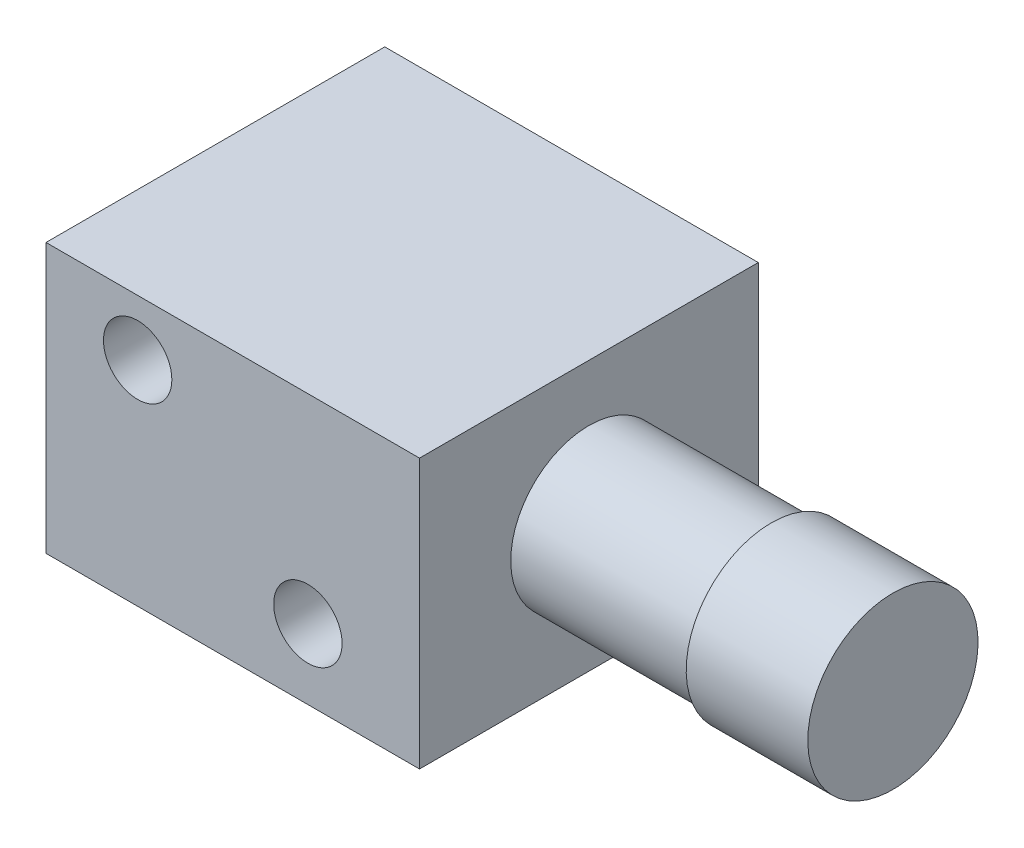
ISO-10303-21;
HEADER;
FILE_DESCRIPTION(('STEP AP214'),'2;1');
FILE_NAME('part.step','',(''),(''),'','','');
FILE_SCHEMA(('AUTOMOTIVE_DESIGN { 1 0 10303 214 1 1 1 1 }'));
ENDSEC;
DATA;
#1=APPLICATION_CONTEXT('core data for automotive mechanical design processes');
#2=APPLICATION_PROTOCOL_DEFINITION('international standard','automotive_design',2000,#1);
#3=PRODUCT_CONTEXT('',#1,'mechanical');
#4=PRODUCT('Part','Part','',(#3));
#5=PRODUCT_RELATED_PRODUCT_CATEGORY('part','',(#4));
#6=PRODUCT_DEFINITION_FORMATION('','',#4);
#7=PRODUCT_DEFINITION_CONTEXT('part definition',#1,'design');
#8=PRODUCT_DEFINITION('design','',#6,#7);
#9=PRODUCT_DEFINITION_SHAPE('','',#8);
#10=(LENGTH_UNIT() NAMED_UNIT(*) SI_UNIT(.MILLI.,.METRE.));
#11=(NAMED_UNIT(*) PLANE_ANGLE_UNIT() SI_UNIT($,.RADIAN.));
#12=(NAMED_UNIT(*) SI_UNIT($,.STERADIAN.) SOLID_ANGLE_UNIT());
#13=UNCERTAINTY_MEASURE_WITH_UNIT(LENGTH_MEASURE(1.E-05),#10,'distance_accuracy_value','');
#14=(GEOMETRIC_REPRESENTATION_CONTEXT(3) GLOBAL_UNCERTAINTY_ASSIGNED_CONTEXT((#13)) GLOBAL_UNIT_ASSIGNED_CONTEXT((#10,
#11,#12)) REPRESENTATION_CONTEXT('',''));
#15=CARTESIAN_POINT('',(0.,0.,0.));
#16=DIRECTION('',(0.,0.,1.));
#17=DIRECTION('',(1.,0.,0.));
#18=AXIS2_PLACEMENT_3D('',#15,#16,#17);
#19=CARTESIAN_POINT('',(-5.461,3.937,9.906));
#20=DIRECTION('',(1.,0.,0.));
#21=DIRECTION('',(0.,1.,0.));
#22=AXIS2_PLACEMENT_3D('',#19,#20,#21);
#23=PLANE('',#22);
#24=CARTESIAN_POINT('',(-5.461,0.,4.953));
#25=DIRECTION('',(-1.,0.,0.));
#26=DIRECTION('',(0.,-1.,0.));
#27=AXIS2_PLACEMENT_3D('',#24,#25,#26);
#28=CIRCLE('',#27,1.524);
#29=CARTESIAN_POINT('',(-5.461,-1.524,4.953));
#30=VERTEX_POINT('',#29);
#31=EDGE_CURVE('E59',#30,#30,#28,.T.);
#32=ORIENTED_EDGE('',*,*,#31,.F.);
#33=EDGE_LOOP('',(#32));
#34=FACE_BOUND('',#33,.T.);
#35=DIRECTION('',(0.,0.,-1.));
#36=VECTOR('',#35,1.);
#37=CARTESIAN_POINT('',(-5.461,0.634999999999999,0.254));
#38=LINE('',#37,#36);
#39=CARTESIAN_POINT('',(-5.461,0.635000000000001,0.254000000000001));
#40=VERTEX_POINT('',#39);
#41=CARTESIAN_POINT('',(-5.461,0.634999999999999,0.));
#42=VERTEX_POINT('',#41);
#43=EDGE_CURVE('E66',#40,#42,#38,.T.);
#44=ORIENTED_EDGE('',*,*,#43,.F.);
#45=DIRECTION('',(0.,1.,0.));
#46=VECTOR('',#45,1.);
#47=CARTESIAN_POINT('',(-5.461,0.634999999999999,0.254));
#48=LINE('',#47,#46);
#49=CARTESIAN_POINT('',(-5.461,-0.635000000000001,0.254000000000001));
#50=VERTEX_POINT('',#49);
#51=EDGE_CURVE('E71',#50,#40,#48,.T.);
#52=ORIENTED_EDGE('',*,*,#51,.F.);
#53=DIRECTION('',(0.,0.,-1.));
#54=VECTOR('',#53,1.);
#55=CARTESIAN_POINT('',(-5.461,-0.635000000000001,0.254));
#56=LINE('',#55,#54);
#57=CARTESIAN_POINT('',(-5.461,-0.635000000000001,0.));
#58=VERTEX_POINT('',#57);
#59=EDGE_CURVE('E140',#50,#58,#56,.T.);
#60=ORIENTED_EDGE('',*,*,#59,.T.);
#61=DIRECTION('',(0.,-1.,0.));
#62=VECTOR('',#61,1.);
#63=CARTESIAN_POINT('',(-5.461,3.937,0.));
#64=LINE('',#63,#62);
#65=CARTESIAN_POINT('',(-5.461,-3.937,0.));
#66=VERTEX_POINT('',#65);
#67=EDGE_CURVE('E225',#58,#66,#64,.T.);
#68=ORIENTED_EDGE('',*,*,#67,.T.);
#69=DIRECTION('',(0.,0.,-1.));
#70=VECTOR('',#69,1.);
#71=CARTESIAN_POINT('',(-5.461,-3.937,9.906));
#72=LINE('',#71,#70);
#73=CARTESIAN_POINT('',(-5.461,-3.937,9.906));
#74=VERTEX_POINT('',#73);
#75=EDGE_CURVE('E234',#74,#66,#72,.T.);
#76=ORIENTED_EDGE('',*,*,#75,.F.);
#77=DIRECTION('',(0.,-1.,0.));
#78=VECTOR('',#77,1.);
#79=CARTESIAN_POINT('',(-5.461,3.937,9.906));
#80=LINE('',#79,#78);
#81=CARTESIAN_POINT('',(-5.461,3.937,9.906));
#82=VERTEX_POINT('',#81);
#83=EDGE_CURVE('E212',#82,#74,#80,.T.);
#84=ORIENTED_EDGE('',*,*,#83,.F.);
#85=DIRECTION('',(0.,0.,-1.));
#86=VECTOR('',#85,1.);
#87=CARTESIAN_POINT('',(-5.461,3.937,9.906));
#88=LINE('',#87,#86);
#89=CARTESIAN_POINT('',(-5.461,3.937,0.));
#90=VERTEX_POINT('',#89);
#91=EDGE_CURVE('E238',#82,#90,#88,.T.);
#92=ORIENTED_EDGE('',*,*,#91,.T.);
#93=EDGE_CURVE('E226',#90,#42,#64,.T.);
#94=ORIENTED_EDGE('',*,*,#93,.T.);
#95=EDGE_LOOP('',(#44,#52,#60,#68,#76,#84,#92,#94));
#96=FACE_BOUND('',#95,.T.);
#97=ADVANCED_FACE('F45',(#34,#96),#23,.F.);
#98=CARTESIAN_POINT('',(14.351,0.,4.953));
#99=DIRECTION('',(-1.,0.,0.));
#100=DIRECTION('',(0.,-1.,0.));
#101=AXIS2_PLACEMENT_3D('',#98,#99,#100);
#102=CYLINDRICAL_SURFACE('',#101,2.4892);
#103=CARTESIAN_POINT('',(14.351,0.,4.953));
#104=DIRECTION('',(1.,0.,0.));
#105=DIRECTION('',(0.,1.,0.));
#106=AXIS2_PLACEMENT_3D('',#103,#104,#105);
#107=CIRCLE('',#106,2.4892);
#108=CARTESIAN_POINT('',(14.351,2.4892,4.953));
#109=VERTEX_POINT('',#108);
#110=EDGE_CURVE('E188',#109,#109,#107,.T.);
#111=ORIENTED_EDGE('',*,*,#110,.F.);
#112=EDGE_LOOP('',(#111));
#113=FACE_BOUND('',#112,.T.);
#114=CARTESIAN_POINT('',(10.795,0.,4.953));
#115=DIRECTION('',(1.,0.,0.));
#116=DIRECTION('',(0.,1.,0.));
#117=AXIS2_PLACEMENT_3D('',#114,#115,#116);
#118=CIRCLE('',#117,2.4892);
#119=CARTESIAN_POINT('',(10.795,2.4892,4.953));
#120=VERTEX_POINT('',#119);
#121=EDGE_CURVE('E183',#120,#120,#118,.T.);
#122=ORIENTED_EDGE('',*,*,#121,.T.);
#123=EDGE_LOOP('',(#122));
#124=FACE_BOUND('',#123,.T.);
#125=CARTESIAN_POINT('',(13.462,-2.4892,4.953));
#126=CARTESIAN_POINT('',(13.4620010042293,-2.48920072170069,5.00130461884046));
#127=CARTESIAN_POINT('',(13.458050437128,-2.48778135728258,5.04960209328934));
#128=CARTESIAN_POINT('',(13.4424095382745,-2.48226012799728,5.14476259723341));
#129=CARTESIAN_POINT('',(13.430719501959,-2.47815836552463,5.19162568141176));
#130=CARTESIAN_POINT('',(13.4000597637653,-2.46771503848785,5.28253171668939));
#131=CARTESIAN_POINT('',(13.3811032901636,-2.46137754564777,5.32657962369089));
#132=CARTESIAN_POINT('',(13.3365127713929,-2.44710079348305,5.41086908532112));
#133=CARTESIAN_POINT('',(13.3108771264199,-2.43916115051216,5.45110972487611));
#134=CARTESIAN_POINT('',(13.2526073822194,-2.4221600741402,5.52821430277581));
#135=CARTESIAN_POINT('',(13.2197586192545,-2.41306898239467,5.56490942373266));
#136=CARTESIAN_POINT('',(13.1484509930363,-2.39494296613896,5.63240295679056));
#137=CARTESIAN_POINT('',(13.1099906412304,-2.38590805719713,5.66319979926199));
#138=CARTESIAN_POINT('',(13.026959744889,-2.36858072952086,5.71904680365791));
#139=CARTESIAN_POINT('',(12.9822263492055,-2.36032383120094,5.74386695195042));
#140=CARTESIAN_POINT('',(12.8888781768311,-2.34594423731755,5.78555764684989));
#141=CARTESIAN_POINT('',(12.8402647942997,-2.33982077937035,5.80243103398738));
#142=CARTESIAN_POINT('',(12.7424708394464,-2.33071632791763,5.82709726787496));
#143=CARTESIAN_POINT('',(12.693381514451,-2.32762507989573,5.83520988701247));
#144=CARTESIAN_POINT('',(12.5944485005235,-2.32461076004459,5.84312423732092));
#145=CARTESIAN_POINT('',(12.5446050937322,-2.32468653120839,5.84292900359884));
#146=CARTESIAN_POINT('',(12.4484135290633,-2.32790193198482,5.83447934082561));
#147=CARTESIAN_POINT('',(12.4020209936733,-2.3308775052071,5.82665643523153));
#148=CARTESIAN_POINT('',(12.3112565209336,-2.3392864442121,5.80388270635179));
#149=CARTESIAN_POINT('',(12.2668848605142,-2.34472014573523,5.78893090936028));
#150=CARTESIAN_POINT('',(12.1804980559986,-2.35753970625466,5.75206721969762));
#151=CARTESIAN_POINT('',(12.1385387292946,-2.36495850828805,5.73003648073866));
#152=CARTESIAN_POINT('',(12.0587823489074,-2.38090013424029,5.67972290968811));
#153=CARTESIAN_POINT('',(12.0209866395559,-2.38942331281397,5.65143806710971));
#154=CARTESIAN_POINT('',(11.9482251693084,-2.40724308454472,5.58740159801151));
#155=CARTESIAN_POINT('',(11.913569009251,-2.41655527067479,5.5513017348689));
#156=CARTESIAN_POINT('',(11.8507153495839,-2.43445706414121,5.47369151220615));
#157=CARTESIAN_POINT('',(11.8225186665186,-2.44304658003788,5.43218046969688));
#158=CARTESIAN_POINT('',(11.7730846951056,-2.45867884745544,5.34419568194297));
#159=CARTESIAN_POINT('',(11.7519415618952,-2.46570028839799,5.2976649843784));
#160=CARTESIAN_POINT('',(11.7178830529286,-2.47724888029623,5.20139494526605));
#161=CARTESIAN_POINT('',(11.7049643763928,-2.48177703180276,5.15165689978352));
#162=CARTESIAN_POINT('',(11.6882959500255,-2.48765741655987,5.052996530649));
#163=CARTESIAN_POINT('',(11.6841286807068,-2.48915414182077,5.00415327804293));
#164=CARTESIAN_POINT('',(11.6838772746203,-2.48924373129939,4.9064486274685));
#165=CARTESIAN_POINT('',(11.6877915398417,-2.48783716960156,4.85758723499717));
#166=CARTESIAN_POINT('',(11.7032685904316,-2.48237372458307,4.76297849063639));
#167=CARTESIAN_POINT('',(11.7145655111618,-2.47840902576585,4.71718178042225));
#168=CARTESIAN_POINT('',(11.7441449730881,-2.46832004205299,4.62815959770293));
#169=CARTESIAN_POINT('',(11.7624284212886,-2.46219547676728,4.58493445988662));
#170=CARTESIAN_POINT('',(11.8060272882696,-2.44818416992275,4.50091935173206));
#171=CARTESIAN_POINT('',(11.8315265204656,-2.44025259331602,4.46023246936174));
#172=CARTESIAN_POINT('',(11.8886220172602,-2.42351497444707,4.38358505639295));
#173=CARTESIAN_POINT('',(11.9202203735536,-2.41470863268847,4.34762615438856));
#174=CARTESIAN_POINT('',(11.9905732973984,-2.39662324165537,4.27948544943552));
#175=CARTESIAN_POINT('',(12.0296164279498,-2.38734364240455,4.24760096713881));
#176=CARTESIAN_POINT('',(12.1126904756135,-2.36981752704785,4.19078731032063));
#177=CARTESIAN_POINT('',(12.1567216361093,-2.36157106139356,4.16585847539522));
#178=CARTESIAN_POINT('',(12.2487158461643,-2.34710342399369,4.12370991224898));
#179=CARTESIAN_POINT('',(12.2966830364333,-2.34088442023693,4.10649842895152));
#180=CARTESIAN_POINT('',(12.3951146918161,-2.33131872776708,4.08049479397644));
#181=CARTESIAN_POINT('',(12.4455777882275,-2.32797048286278,4.0716980804908));
#182=CARTESIAN_POINT('',(12.544381482465,-2.32471934089738,4.0631598754176));
#183=CARTESIAN_POINT('',(12.5926729350493,-2.3246258548261,4.06291745766558));
#184=CARTESIAN_POINT('',(12.6885691716849,-2.32741380401317,4.07023354350846));
#185=CARTESIAN_POINT('',(12.7361740088678,-2.33029500781803,4.0777914401796));
#186=CARTESIAN_POINT('',(12.8281432081582,-2.3385561067212,4.10011826494882));
#187=CARTESIAN_POINT('',(12.8725588976065,-2.34387152242943,4.11470158665223));
#188=CARTESIAN_POINT('',(12.9583433376719,-2.35637034704456,4.15050807673347));
#189=CARTESIAN_POINT('',(12.9997113521438,-2.36355420537517,4.17173284285328));
#190=CARTESIAN_POINT('',(13.080414796683,-2.37941643341762,4.22142300671631));
#191=CARTESIAN_POINT('',(13.1195529473309,-2.38815057159788,4.25019083860756));
#192=CARTESIAN_POINT('',(13.1926072206573,-2.40591994268349,4.3136636911296));
#193=CARTESIAN_POINT('',(13.2265217583568,-2.41495526596856,4.34837050708459));
#194=CARTESIAN_POINT('',(13.2897907086416,-2.43282120479436,4.42469840668065));
#195=CARTESIAN_POINT('',(13.3188543009496,-2.44162202530363,4.466568534807));
#196=CARTESIAN_POINT('',(13.3695111652608,-2.45756911117296,4.55490177727691));
#197=CARTESIAN_POINT('',(13.3911050024161,-2.46471550169157,4.60136454380508));
#198=CARTESIAN_POINT('',(13.4261342943457,-2.47656199797904,4.69780496273172));
#199=CARTESIAN_POINT('',(13.4395351151426,-2.48125170693917,4.74779655349766));
#200=CARTESIAN_POINT('',(13.4574656998216,-2.48756972433911,4.84952862106846));
#201=CARTESIAN_POINT('',(13.4619989245256,-2.48919922709822,4.90126840756881));
#202=CARTESIAN_POINT('',(13.462,-2.4892,4.953));
#203=B_SPLINE_CURVE_WITH_KNOTS('',3,(#125,#126,#127,#128,#129,#130,#131,#132,#133,#134,#135,
#136,#137,#138,#139,#140,#141,#142,#143,#144,#145,#146,#147,#148,#149,#150,#151,#152,#153,#154,
#155,#156,#157,#158,#159,#160,#161,#162,#163,#164,#165,#166,#167,#168,#169,#170,#171,#172,#173,
#174,#175,#176,#177,#178,#179,#180,#181,#182,#183,#184,#185,#186,#187,#188,#189,#190,#191,#192,
#193,#194,#195,#196,#197,#198,#199,#200,#201,#202),.UNSPECIFIED.,.T.,.F.,(4,2,2,2,2,2,2,2,2,2,2,
2,2,2,2,2,2,2,2,2,2,2,2,2,2,2,2,2,2,2,2,2,2,2,2,2,2,2,4),(0.,0.144723232016034,
0.289440939869288,0.433896436233538,0.578386564628413,0.727965019666057,0.877583224867919,
1.03226984171087,1.18690112454325,1.33567471581875,1.48439395612114,1.6251604405467,
1.76594615719541,1.90923115622463,2.05256228376794,2.20456585854855,2.35658863755242,
2.51056631405945,2.6644821545907,2.81087053236736,2.95722996665894,3.09858932611085,
3.23996704334508,3.3853328273253,3.53074855336568,3.68379689577458,3.83685270916653,
3.99007165417729,4.14320748910765,4.28736006484191,4.43150142525552,4.57202772488643,
4.71258785715941,4.85999745131772,5.00745168561116,5.16186625765119,5.31626914432236,
5.4713202982844,5.62631092720758),.UNSPECIFIED.);
#204=CARTESIAN_POINT('',(13.462,-2.4892,4.953));
#205=VERTEX_POINT('',#204);
#206=EDGE_CURVE('E11',#205,#205,#203,.T.);
#207=ORIENTED_EDGE('',*,*,#206,.F.);
#208=EDGE_LOOP('',(#207));
#209=FACE_BOUND('',#208,.T.);
#210=ADVANCED_FACE('F273',(#113,#124,#209),#102,.T.);
#211=CARTESIAN_POINT('',(5.461,3.937,9.906));
#212=DIRECTION('',(-1.,0.,0.));
#213=DIRECTION('',(0.,-1.,0.));
#214=AXIS2_PLACEMENT_3D('',#211,#212,#213);
#215=PLANE('',#214);
#216=CARTESIAN_POINT('',(5.461,0.,4.953));
#217=DIRECTION('',(1.,0.,0.));
#218=DIRECTION('',(0.,1.,0.));
#219=AXIS2_PLACEMENT_3D('',#216,#217,#218);
#220=CIRCLE('',#219,2.286);
#221=CARTESIAN_POINT('',(5.461,2.286,4.953));
#222=VERTEX_POINT('',#221);
#223=EDGE_CURVE('E187',#222,#222,#220,.T.);
#224=ORIENTED_EDGE('',*,*,#223,.F.);
#225=EDGE_LOOP('',(#224));
#226=FACE_BOUND('',#225,.T.);
#227=DIRECTION('',(0.,1.,0.));
#228=VECTOR('',#227,1.);
#229=CARTESIAN_POINT('',(5.461,3.937,0.));
#230=LINE('',#229,#228);
#231=CARTESIAN_POINT('',(5.461,-3.937,0.));
#232=VERTEX_POINT('',#231);
#233=CARTESIAN_POINT('',(5.461,3.937,0.));
#234=VERTEX_POINT('',#233);
#235=EDGE_CURVE('E199',#232,#234,#230,.T.);
#236=ORIENTED_EDGE('',*,*,#235,.T.);
#237=DIRECTION('',(0.,0.,-1.));
#238=VECTOR('',#237,1.);
#239=CARTESIAN_POINT('',(5.461,3.937,9.906));
#240=LINE('',#239,#238);
#241=CARTESIAN_POINT('',(5.461,3.937,9.906));
#242=VERTEX_POINT('',#241);
#243=EDGE_CURVE('E203',#242,#234,#240,.T.);
#244=ORIENTED_EDGE('',*,*,#243,.F.);
#245=DIRECTION('',(0.,1.,0.));
#246=VECTOR('',#245,1.);
#247=CARTESIAN_POINT('',(5.461,3.937,9.906));
#248=LINE('',#247,#246);
#249=CARTESIAN_POINT('',(5.461,-3.937,9.906));
#250=VERTEX_POINT('',#249);
#251=EDGE_CURVE('E204',#250,#242,#248,.T.);
#252=ORIENTED_EDGE('',*,*,#251,.F.);
#253=DIRECTION('',(0.,0.,-1.));
#254=VECTOR('',#253,1.);
#255=CARTESIAN_POINT('',(5.461,-3.937,9.906));
#256=LINE('',#255,#254);
#257=EDGE_CURVE('E218',#250,#232,#256,.T.);
#258=ORIENTED_EDGE('',*,*,#257,.T.);
#259=EDGE_LOOP('',(#236,#244,#252,#258));
#260=FACE_BOUND('',#259,.T.);
#261=ADVANCED_FACE('F47',(#226,#260),#215,.F.);
#262=CARTESIAN_POINT('',(-5.461,3.937,9.906));
#263=DIRECTION('',(0.,-1.,0.));
#264=DIRECTION('',(0.,0.,-1.));
#265=AXIS2_PLACEMENT_3D('',#262,#263,#264);
#266=PLANE('',#265);
#267=DIRECTION('',(-1.,0.,0.));
#268=VECTOR('',#267,1.);
#269=CARTESIAN_POINT('',(-5.461,3.937,0.));
#270=LINE('',#269,#268);
#271=EDGE_CURVE('E222',#234,#90,#270,.T.);
#272=ORIENTED_EDGE('',*,*,#271,.T.);
#273=ORIENTED_EDGE('',*,*,#91,.F.);
#274=DIRECTION('',(-1.,0.,0.));
#275=VECTOR('',#274,1.);
#276=CARTESIAN_POINT('',(-5.461,3.937,9.906));
#277=LINE('',#276,#275);
#278=EDGE_CURVE('E208',#242,#82,#277,.T.);
#279=ORIENTED_EDGE('',*,*,#278,.F.);
#280=ORIENTED_EDGE('',*,*,#243,.T.);
#281=EDGE_LOOP('',(#272,#273,#279,#280));
#282=FACE_BOUND('',#281,.T.);
#283=ADVANCED_FACE('F245',(#282),#266,.F.);
#284=CARTESIAN_POINT('',(-5.461,-3.937,9.906));
#285=DIRECTION('',(0.,1.,0.));
#286=DIRECTION('',(0.,0.,1.));
#287=AXIS2_PLACEMENT_3D('',#284,#285,#286);
#288=PLANE('',#287);
#289=DIRECTION('',(1.,0.,0.));
#290=VECTOR('',#289,1.);
#291=CARTESIAN_POINT('',(-5.461,-3.937,0.));
#292=LINE('',#291,#290);
#293=EDGE_CURVE('E209',#66,#232,#292,.T.);
#294=ORIENTED_EDGE('',*,*,#293,.T.);
#295=ORIENTED_EDGE('',*,*,#257,.F.);
#296=DIRECTION('',(1.,0.,0.));
#297=VECTOR('',#296,1.);
#298=CARTESIAN_POINT('',(-5.461,-3.937,9.906));
#299=LINE('',#298,#297);
#300=EDGE_CURVE('E215',#74,#250,#299,.T.);
#301=ORIENTED_EDGE('',*,*,#300,.F.);
#302=ORIENTED_EDGE('',*,*,#75,.T.);
#303=EDGE_LOOP('',(#294,#295,#301,#302));
#304=FACE_BOUND('',#303,.T.);
#305=ADVANCED_FACE('F261',(#304),#288,.F.);
#306=CARTESIAN_POINT('',(0.,0.,9.906));
#307=DIRECTION('',(0.,0.,1.));
#308=DIRECTION('',(1.,0.,0.));
#309=AXIS2_PLACEMENT_3D('',#306,#307,#308);
#310=PLANE('',#309);
#311=CARTESIAN_POINT('',(2.1973108105945,-1.89049353733098,9.906));
#312=DIRECTION('',(0.,0.,1.));
#313=DIRECTION('',(1.,0.,0.));
#314=AXIS2_PLACEMENT_3D('',#311,#312,#313);
#315=CIRCLE('',#314,1.);
#316=CARTESIAN_POINT('',(3.1973108105945,-1.89049353733098,9.906));
#317=VERTEX_POINT('',#316);
#318=EDGE_CURVE('E169',#317,#317,#315,.T.);
#319=ORIENTED_EDGE('',*,*,#318,.F.);
#320=EDGE_LOOP('',(#319));
#321=FACE_BOUND('',#320,.T.);
#322=CARTESIAN_POINT('',(-2.7810891894055,2.30050646266902,9.906));
#323=DIRECTION('',(0.,0.,1.));
#324=DIRECTION('',(1.,0.,0.));
#325=AXIS2_PLACEMENT_3D('',#322,#323,#324);
#326=CIRCLE('',#325,1.);
#327=CARTESIAN_POINT('',(-1.7810891894055,2.30050646266902,9.906));
#328=VERTEX_POINT('',#327);
#329=EDGE_CURVE('E173',#328,#328,#326,.T.);
#330=ORIENTED_EDGE('',*,*,#329,.F.);
#331=EDGE_LOOP('',(#330));
#332=FACE_BOUND('',#331,.T.);
#333=ORIENTED_EDGE('',*,*,#251,.T.);
#334=ORIENTED_EDGE('',*,*,#278,.T.);
#335=ORIENTED_EDGE('',*,*,#83,.T.);
#336=ORIENTED_EDGE('',*,*,#300,.T.);
#337=EDGE_LOOP('',(#333,#334,#335,#336));
#338=FACE_BOUND('',#337,.T.);
#339=ADVANCED_FACE('F259',(#321,#332,#338),#310,.T.);
#340=CARTESIAN_POINT('',(0.,0.,0.));
#341=DIRECTION('',(0.,0.,1.));
#342=DIRECTION('',(1.,0.,0.));
#343=AXIS2_PLACEMENT_3D('',#340,#341,#342);
#344=PLANE('',#343);
#345=ORIENTED_EDGE('',*,*,#235,.F.);
#346=ORIENTED_EDGE('',*,*,#293,.F.);
#347=ORIENTED_EDGE('',*,*,#67,.F.);
#348=DIRECTION('',(1.,0.,0.));
#349=VECTOR('',#348,1.);
#350=CARTESIAN_POINT('',(-5.461,-0.635000000000001,0.));
#351=LINE('',#350,#349);
#352=CARTESIAN_POINT('',(-6.68215432546261,-0.635,0.));
#353=VERTEX_POINT('',#352);
#354=EDGE_CURVE('E149',#353,#58,#351,.T.);
#355=ORIENTED_EDGE('',*,*,#354,.F.);
#356=DIRECTION('',(0.,-1.,0.));
#357=VECTOR('',#356,1.);
#358=CARTESIAN_POINT('',(-6.68215432546261,0.635,0.));
#359=LINE('',#358,#357);
#360=CARTESIAN_POINT('',(-6.68215432546261,0.635,0.));
#361=VERTEX_POINT('',#360);
#362=EDGE_CURVE('E146',#361,#353,#359,.T.);
#363=ORIENTED_EDGE('',*,*,#362,.F.);
#364=DIRECTION('',(-1.,0.,0.));
#365=VECTOR('',#364,1.);
#366=CARTESIAN_POINT('',(-5.461,0.634999999999999,0.));
#367=LINE('',#366,#365);
#368=EDGE_CURVE('E127',#42,#361,#367,.T.);
#369=ORIENTED_EDGE('',*,*,#368,.F.);
#370=ORIENTED_EDGE('',*,*,#93,.F.);
#371=ORIENTED_EDGE('',*,*,#271,.F.);
#372=EDGE_LOOP('',(#345,#346,#347,#355,#363,#369,#370,#371));
#373=FACE_BOUND('',#372,.T.);
#374=ADVANCED_FACE('F253',(#373),#344,.F.);
#375=CARTESIAN_POINT('',(10.795,0.,4.953));
#376=DIRECTION('',(-1.,0.,0.));
#377=DIRECTION('',(0.,-1.,0.));
#378=AXIS2_PLACEMENT_3D('',#375,#376,#377);
#379=CYLINDRICAL_SURFACE('',#378,2.286);
#380=CARTESIAN_POINT('',(10.795,0.,4.953));
#381=DIRECTION('',(1.,0.,0.));
#382=DIRECTION('',(0.,1.,0.));
#383=AXIS2_PLACEMENT_3D('',#380,#381,#382);
#384=CIRCLE('',#383,2.286);
#385=CARTESIAN_POINT('',(10.795,2.286,4.953));
#386=VERTEX_POINT('',#385);
#387=EDGE_CURVE('E192',#386,#386,#384,.T.);
#388=ORIENTED_EDGE('',*,*,#387,.F.);
#389=EDGE_LOOP('',(#388));
#390=FACE_BOUND('',#389,.T.);
#391=ORIENTED_EDGE('',*,*,#223,.T.);
#392=EDGE_LOOP('',(#391));
#393=FACE_BOUND('',#392,.T.);
#394=ADVANCED_FACE('F301',(#390,#393),#379,.T.);
#395=CARTESIAN_POINT('',(14.351,0.,4.953));
#396=DIRECTION('',(1.,0.,0.));
#397=DIRECTION('',(0.,1.,0.));
#398=AXIS2_PLACEMENT_3D('',#395,#396,#397);
#399=PLANE('',#398);
#400=ORIENTED_EDGE('',*,*,#110,.T.);
#401=EDGE_LOOP('',(#400));
#402=FACE_BOUND('',#401,.T.);
#403=ADVANCED_FACE('F294',(#402),#399,.T.);
#404=CARTESIAN_POINT('',(10.795,0.,4.953));
#405=DIRECTION('',(1.,0.,0.));
#406=DIRECTION('',(0.,1.,0.));
#407=AXIS2_PLACEMENT_3D('',#404,#405,#406);
#408=PLANE('',#407);
#409=ORIENTED_EDGE('',*,*,#387,.T.);
#410=EDGE_LOOP('',(#409));
#411=FACE_BOUND('',#410,.T.);
#412=ORIENTED_EDGE('',*,*,#121,.F.);
#413=EDGE_LOOP('',(#412));
#414=FACE_BOUND('',#413,.T.);
#415=ADVANCED_FACE('F284',(#411,#414),#408,.F.);
#416=CARTESIAN_POINT('',(-7.366,0.,4.953));
#417=DIRECTION('',(1.,0.,0.));
#418=DIRECTION('',(0.,1.,0.));
#419=AXIS2_PLACEMENT_3D('',#416,#417,#418);
#420=CYLINDRICAL_SURFACE('',#419,1.524);
#421=CARTESIAN_POINT('',(-7.366,0.,4.953));
#422=DIRECTION('',(-1.,0.,0.));
#423=DIRECTION('',(0.,-1.,0.));
#424=AXIS2_PLACEMENT_3D('',#421,#422,#423);
#425=CIRCLE('',#424,1.524);
#426=CARTESIAN_POINT('',(-7.366,-1.524,4.953));
#427=VERTEX_POINT('',#426);
#428=EDGE_CURVE('E168',#427,#427,#425,.T.);
#429=ORIENTED_EDGE('',*,*,#428,.F.);
#430=EDGE_LOOP('',(#429));
#431=FACE_BOUND('',#430,.T.);
#432=ORIENTED_EDGE('',*,*,#31,.T.);
#433=EDGE_LOOP('',(#432));
#434=FACE_BOUND('',#433,.T.);
#435=ADVANCED_FACE('F281',(#431,#434),#420,.T.);
#436=CARTESIAN_POINT('',(-7.366,0.,4.953));
#437=DIRECTION('',(-1.,0.,0.));
#438=DIRECTION('',(0.,-1.,0.));
#439=AXIS2_PLACEMENT_3D('',#436,#437,#438);
#440=PLANE('',#439);
#441=ORIENTED_EDGE('',*,*,#428,.T.);
#442=EDGE_LOOP('',(#441));
#443=FACE_BOUND('',#442,.T.);
#444=ADVANCED_FACE('F283',(#443),#440,.T.);
#445=CARTESIAN_POINT('',(-2.7810891894055,2.30050646266902,6.096));
#446=DIRECTION('',(0.,0.,1.));
#447=DIRECTION('',(1.,0.,0.));
#448=AXIS2_PLACEMENT_3D('',#445,#446,#447);
#449=CYLINDRICAL_SURFACE('',#448,1.);
#450=CARTESIAN_POINT('',(-2.7810891894055,2.30050646266902,6.096));
#451=DIRECTION('',(0.,0.,1.));
#452=DIRECTION('',(1.,0.,0.));
#453=AXIS2_PLACEMENT_3D('',#450,#451,#452);
#454=CIRCLE('',#453,1.);
#455=CARTESIAN_POINT('',(-1.7810891894055,2.30050646266902,6.096));
#456=VERTEX_POINT('',#455);
#457=EDGE_CURVE('E163',#456,#456,#454,.T.);
#458=ORIENTED_EDGE('',*,*,#457,.F.);
#459=EDGE_LOOP('',(#458));
#460=FACE_BOUND('',#459,.T.);
#461=ORIENTED_EDGE('',*,*,#329,.T.);
#462=EDGE_LOOP('',(#461));
#463=FACE_BOUND('',#462,.T.);
#464=ADVANCED_FACE('F291',(#460,#463),#449,.F.);
#465=CARTESIAN_POINT('',(-2.7810891894055,2.30050646266902,6.096));
#466=DIRECTION('',(0.,0.,1.));
#467=DIRECTION('',(1.,0.,0.));
#468=AXIS2_PLACEMENT_3D('',#465,#466,#467);
#469=PLANE('',#468);
#470=ORIENTED_EDGE('',*,*,#457,.T.);
#471=EDGE_LOOP('',(#470));
#472=FACE_BOUND('',#471,.T.);
#473=ADVANCED_FACE('F358',(#472),#469,.T.);
#474=CARTESIAN_POINT('',(2.1973108105945,-1.89049353733098,6.096));
#475=DIRECTION('',(0.,0.,1.));
#476=DIRECTION('',(1.,0.,0.));
#477=AXIS2_PLACEMENT_3D('',#474,#475,#476);
#478=CYLINDRICAL_SURFACE('',#477,1.);
#479=CARTESIAN_POINT('',(2.1973108105945,-1.89049353733098,6.096));
#480=DIRECTION('',(0.,0.,1.));
#481=DIRECTION('',(1.,0.,0.));
#482=AXIS2_PLACEMENT_3D('',#479,#480,#481);
#483=CIRCLE('',#482,1.);
#484=CARTESIAN_POINT('',(3.1973108105945,-1.89049353733098,6.096));
#485=VERTEX_POINT('',#484);
#486=EDGE_CURVE('E164',#485,#485,#483,.T.);
#487=ORIENTED_EDGE('',*,*,#486,.F.);
#488=EDGE_LOOP('',(#487));
#489=FACE_BOUND('',#488,.T.);
#490=ORIENTED_EDGE('',*,*,#318,.T.);
#491=EDGE_LOOP('',(#490));
#492=FACE_BOUND('',#491,.T.);
#493=ADVANCED_FACE('F369',(#489,#492),#478,.F.);
#494=CARTESIAN_POINT('',(0.,0.,6.096));
#495=DIRECTION('',(0.,0.,1.));
#496=DIRECTION('',(1.,0.,0.));
#497=AXIS2_PLACEMENT_3D('',#494,#495,#496);
#498=PLANE('',#497);
#499=ORIENTED_EDGE('',*,*,#486,.T.);
#500=EDGE_LOOP('',(#499));
#501=FACE_BOUND('',#500,.T.);
#502=ADVANCED_FACE('F379',(#501),#498,.T.);
#503=CARTESIAN_POINT('',(12.573,1.3208,4.953));
#504=DIRECTION('',(0.,-1.,0.));
#505=DIRECTION('',(0.,0.,-1.));
#506=AXIS2_PLACEMENT_3D('',#503,#504,#505);
#507=CYLINDRICAL_SURFACE('',#506,0.889);
#508=CARTESIAN_POINT('',(12.573,1.3208,4.953));
#509=DIRECTION('',(0.,1.,0.));
#510=DIRECTION('',(0.,0.,1.));
#511=AXIS2_PLACEMENT_3D('',#508,#509,#510);
#512=CIRCLE('',#511,0.889);
#513=CARTESIAN_POINT('',(12.573,1.3208,5.842));
#514=VERTEX_POINT('',#513);
#515=EDGE_CURVE('E159',#514,#514,#512,.T.);
#516=ORIENTED_EDGE('',*,*,#515,.T.);
#517=EDGE_LOOP('',(#516));
#518=FACE_BOUND('',#517,.T.);
#519=ORIENTED_EDGE('',*,*,#206,.T.);
#520=EDGE_LOOP('',(#519));
#521=FACE_BOUND('',#520,.T.);
#522=ADVANCED_FACE('F390',(#518,#521),#507,.F.);
#523=CARTESIAN_POINT('',(12.573,1.3208,4.953));
#524=DIRECTION('',(0.,1.,0.));
#525=DIRECTION('',(0.,0.,1.));
#526=AXIS2_PLACEMENT_3D('',#523,#524,#525);
#527=PLANE('',#526);
#528=ORIENTED_EDGE('',*,*,#515,.F.);
#529=EDGE_LOOP('',(#528));
#530=FACE_BOUND('',#529,.T.);
#531=ADVANCED_FACE('F409',(#530),#527,.F.);
#532=CARTESIAN_POINT('',(-5.461,0.634999999999999,0.254));
#533=DIRECTION('',(0.,-1.,0.));
#534=DIRECTION('',(1.,0.,0.));
#535=AXIS2_PLACEMENT_3D('',#532,#533,#534);
#536=PLANE('',#535);
#537=ORIENTED_EDGE('',*,*,#368,.T.);
#538=DIRECTION('',(0.,0.,-1.));
#539=VECTOR('',#538,1.);
#540=CARTESIAN_POINT('',(-6.68215432546261,0.635,0.254));
#541=LINE('',#540,#539);
#542=CARTESIAN_POINT('',(-6.68215432546261,0.635,0.254));
#543=VERTEX_POINT('',#542);
#544=EDGE_CURVE('E124',#543,#361,#541,.T.);
#545=ORIENTED_EDGE('',*,*,#544,.F.);
#546=DIRECTION('',(-1.,0.,0.));
#547=VECTOR('',#546,1.);
#548=CARTESIAN_POINT('',(-5.461,0.634999999999999,0.254));
#549=LINE('',#548,#547);
#550=EDGE_CURVE('E114',#40,#543,#549,.T.);
#551=ORIENTED_EDGE('',*,*,#550,.F.);
#552=ORIENTED_EDGE('',*,*,#43,.T.);
#553=EDGE_LOOP('',(#537,#545,#551,#552));
#554=FACE_BOUND('',#553,.T.);
#555=ADVANCED_FACE('F125',(#554),#536,.F.);
#556=CARTESIAN_POINT('',(-6.68215432546261,0.635,0.254));
#557=DIRECTION('',(1.,0.,0.));
#558=DIRECTION('',(0.,0.,-1.));
#559=AXIS2_PLACEMENT_3D('',#556,#557,#558);
#560=PLANE('',#559);
#561=ORIENTED_EDGE('',*,*,#362,.T.);
#562=DIRECTION('',(0.,0.,-1.));
#563=VECTOR('',#562,1.);
#564=CARTESIAN_POINT('',(-6.68215432546261,-0.635,0.254));
#565=LINE('',#564,#563);
#566=CARTESIAN_POINT('',(-6.68215432546261,-0.635,0.254));
#567=VERTEX_POINT('',#566);
#568=EDGE_CURVE('E131',#567,#353,#565,.T.);
#569=ORIENTED_EDGE('',*,*,#568,.F.);
#570=DIRECTION('',(0.,-1.,0.));
#571=VECTOR('',#570,1.);
#572=CARTESIAN_POINT('',(-6.68215432546261,0.635,0.254));
#573=LINE('',#572,#571);
#574=EDGE_CURVE('E118',#543,#567,#573,.T.);
#575=ORIENTED_EDGE('',*,*,#574,.F.);
#576=ORIENTED_EDGE('',*,*,#544,.T.);
#577=EDGE_LOOP('',(#561,#569,#575,#576));
#578=FACE_BOUND('',#577,.T.);
#579=ADVANCED_FACE('F133',(#578),#560,.F.);
#580=CARTESIAN_POINT('',(-5.461,-0.635000000000001,0.254));
#581=DIRECTION('',(0.,1.,0.));
#582=DIRECTION('',(-1.,0.,0.));
#583=AXIS2_PLACEMENT_3D('',#580,#581,#582);
#584=PLANE('',#583);
#585=ORIENTED_EDGE('',*,*,#354,.T.);
#586=ORIENTED_EDGE('',*,*,#59,.F.);
#587=DIRECTION('',(1.,0.,0.));
#588=VECTOR('',#587,1.);
#589=CARTESIAN_POINT('',(-5.461,-0.635000000000001,0.254));
#590=LINE('',#589,#588);
#591=EDGE_CURVE('E137',#567,#50,#590,.T.);
#592=ORIENTED_EDGE('',*,*,#591,.F.);
#593=ORIENTED_EDGE('',*,*,#568,.T.);
#594=EDGE_LOOP('',(#585,#586,#592,#593));
#595=FACE_BOUND('',#594,.T.);
#596=ADVANCED_FACE('F443',(#595),#584,.F.);
#597=CARTESIAN_POINT('',(0.,0.,0.254));
#598=DIRECTION('',(0.,0.,-1.));
#599=DIRECTION('',(-1.,0.,0.));
#600=AXIS2_PLACEMENT_3D('',#597,#598,#599);
#601=PLANE('',#600);
#602=ORIENTED_EDGE('',*,*,#51,.T.);
#603=ORIENTED_EDGE('',*,*,#550,.T.);
#604=ORIENTED_EDGE('',*,*,#574,.T.);
#605=ORIENTED_EDGE('',*,*,#591,.T.);
#606=EDGE_LOOP('',(#602,#603,#604,#605));
#607=FACE_BOUND('',#606,.T.);
#608=ADVANCED_FACE('F116',(#607),#601,.F.);
#609=CLOSED_SHELL('',(#97,#210,#261,#283,#305,#339,#374,#394,#403,#415,#435,#444,#464,#473,#493,
#502,#522,#531,#555,#579,#596,#608));
#610=MANIFOLD_SOLID_BREP('B2',#609);
#611=ADVANCED_BREP_SHAPE_REPRESENTATION('',(#18,#610),#14);
#612=SHAPE_DEFINITION_REPRESENTATION(#9,#611);
ENDSEC;
END-ISO-10303-21;
